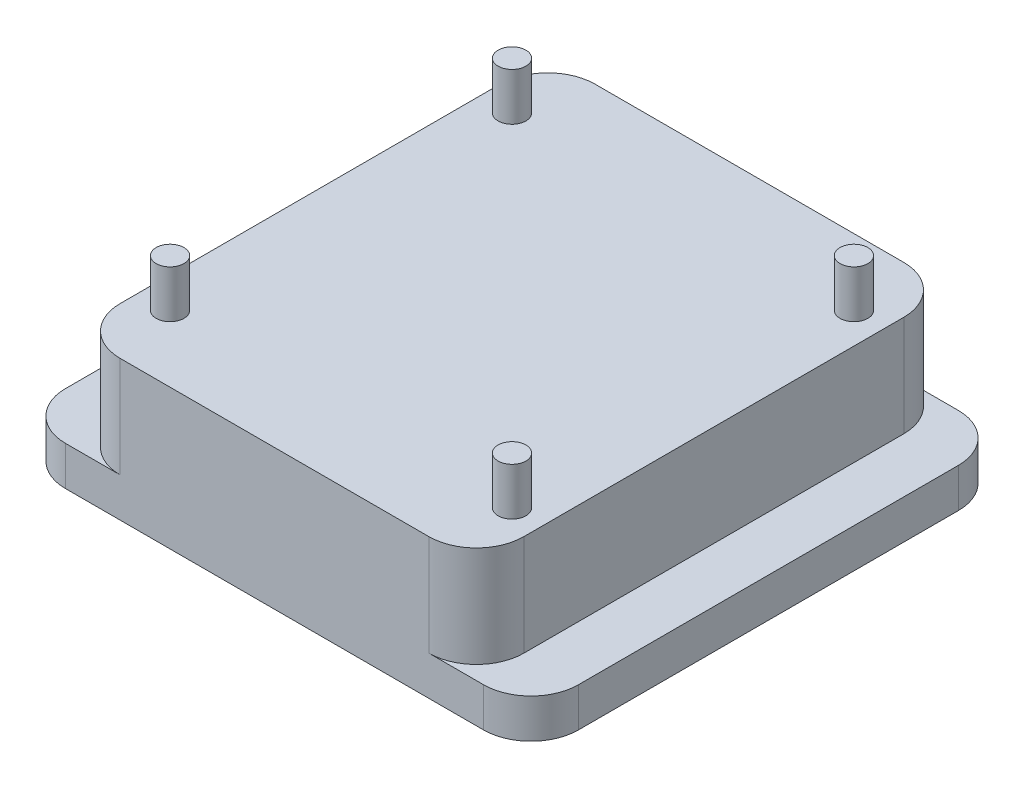
ISO-10303-21;
HEADER;
FILE_DESCRIPTION(('STEP AP214'),'2;1');
FILE_NAME('part.step','',(''),(''),'','','');
FILE_SCHEMA(('AUTOMOTIVE_DESIGN { 1 0 10303 214 1 1 1 1 }'));
ENDSEC;
DATA;
#1=APPLICATION_CONTEXT('core data for automotive mechanical design processes');
#2=APPLICATION_PROTOCOL_DEFINITION('international standard','automotive_design',2000,#1);
#3=PRODUCT_CONTEXT('',#1,'mechanical');
#4=PRODUCT('Part','Part','',(#3));
#5=PRODUCT_RELATED_PRODUCT_CATEGORY('part','',(#4));
#6=PRODUCT_DEFINITION_FORMATION('','',#4);
#7=PRODUCT_DEFINITION_CONTEXT('part definition',#1,'design');
#8=PRODUCT_DEFINITION('design','',#6,#7);
#9=PRODUCT_DEFINITION_SHAPE('','',#8);
#10=(LENGTH_UNIT() NAMED_UNIT(*) SI_UNIT(.MILLI.,.METRE.));
#11=(NAMED_UNIT(*) PLANE_ANGLE_UNIT() SI_UNIT($,.RADIAN.));
#12=(NAMED_UNIT(*) SI_UNIT($,.STERADIAN.) SOLID_ANGLE_UNIT());
#13=UNCERTAINTY_MEASURE_WITH_UNIT(LENGTH_MEASURE(1.E-05),#10,'distance_accuracy_value','');
#14=(GEOMETRIC_REPRESENTATION_CONTEXT(3) GLOBAL_UNCERTAINTY_ASSIGNED_CONTEXT((#13)) GLOBAL_UNIT_ASSIGNED_CONTEXT((#10,
#11,#12)) REPRESENTATION_CONTEXT('',''));
#15=CARTESIAN_POINT('',(0.,0.,0.));
#16=DIRECTION('',(0.,0.,1.));
#17=DIRECTION('',(1.,0.,0.));
#18=AXIS2_PLACEMENT_3D('',#15,#16,#17);
#19=CARTESIAN_POINT('',(-21.59,0.,50.8));
#20=DIRECTION('',(-1.,0.,0.));
#21=DIRECTION('',(0.,0.,1.));
#22=AXIS2_PLACEMENT_3D('',#19,#20,#21);
#23=PLANE('',#22);
#24=DIRECTION('',(0.,0.,-1.));
#25=VECTOR('',#24,1.);
#26=CARTESIAN_POINT('',(-21.59,12.8905,50.8));
#27=LINE('',#26,#25);
#28=CARTESIAN_POINT('',(-21.59,12.8905,45.72));
#29=VERTEX_POINT('',#28);
#30=CARTESIAN_POINT('',(-21.59,12.8905,5.08));
#31=VERTEX_POINT('',#30);
#32=EDGE_CURVE('E193',#29,#31,#27,.T.);
#33=ORIENTED_EDGE('',*,*,#32,.T.);
#34=DIRECTION('',(0.,1.,0.));
#35=VECTOR('',#34,1.);
#36=CARTESIAN_POINT('',(-21.59,2.0955,5.08));
#37=LINE('',#36,#35);
#38=CARTESIAN_POINT('',(-21.59,2.0955,5.08));
#39=VERTEX_POINT('',#38);
#40=EDGE_CURVE('E158',#31,#39,#37,.F.);
#41=ORIENTED_EDGE('',*,*,#40,.T.);
#42=DIRECTION('',(0.,0.,-1.));
#43=VECTOR('',#42,1.);
#44=CARTESIAN_POINT('',(-21.59,2.0955,50.8));
#45=LINE('',#44,#43);
#46=CARTESIAN_POINT('',(-21.59,2.0955,45.72));
#47=VERTEX_POINT('',#46);
#48=EDGE_CURVE('E212',#47,#39,#45,.T.);
#49=ORIENTED_EDGE('',*,*,#48,.F.);
#50=DIRECTION('',(0.,1.,0.));
#51=VECTOR('',#50,1.);
#52=CARTESIAN_POINT('',(-21.59,0.,45.72));
#53=LINE('',#52,#51);
#54=EDGE_CURVE('E163',#47,#29,#53,.T.);
#55=ORIENTED_EDGE('',*,*,#54,.T.);
#56=EDGE_LOOP('',(#33,#41,#49,#55));
#57=FACE_BOUND('',#56,.T.);
#58=ADVANCED_FACE('F39',(#57),#23,.T.);
#59=CARTESIAN_POINT('',(0.,2.0955,50.8));
#60=DIRECTION('',(0.,1.,0.));
#61=DIRECTION('',(0.,0.,1.));
#62=AXIS2_PLACEMENT_3D('',#59,#60,#61);
#63=PLANE('',#62);
#64=DIRECTION('',(0.,0.,-1.));
#65=VECTOR('',#64,1.);
#66=CARTESIAN_POINT('',(-27.432,2.0955,50.8));
#67=LINE('',#66,#65);
#68=CARTESIAN_POINT('',(-27.432,2.0955,45.72));
#69=VERTEX_POINT('',#68);
#70=CARTESIAN_POINT('',(-27.432,2.0955,5.08));
#71=VERTEX_POINT('',#70);
#72=EDGE_CURVE('E209',#69,#71,#67,.T.);
#73=ORIENTED_EDGE('',*,*,#72,.F.);
#74=CARTESIAN_POINT('',(-22.352,2.0955,45.72));
#75=DIRECTION('',(0.,1.,0.));
#76=DIRECTION('',(0.,0.,1.));
#77=AXIS2_PLACEMENT_3D('',#74,#75,#76);
#78=CIRCLE('',#77,5.08);
#79=CARTESIAN_POINT('',(-22.352,2.0955,50.8));
#80=VERTEX_POINT('',#79);
#81=EDGE_CURVE('E250',#69,#80,#78,.T.);
#82=ORIENTED_EDGE('',*,*,#81,.T.);
#83=DIRECTION('',(1.,0.,0.));
#84=VECTOR('',#83,1.);
#85=CARTESIAN_POINT('',(0.,2.0955,50.8));
#86=LINE('',#85,#84);
#87=CARTESIAN_POINT('',(-16.51,2.0955,50.8));
#88=VERTEX_POINT('',#87);
#89=EDGE_CURVE('E182',#80,#88,#86,.T.);
#90=ORIENTED_EDGE('',*,*,#89,.T.);
#91=CARTESIAN_POINT('',(-16.51,2.0955,45.72));
#92=DIRECTION('',(0.,1.,0.));
#93=DIRECTION('',(0.,0.,1.));
#94=AXIS2_PLACEMENT_3D('',#91,#92,#93);
#95=CIRCLE('',#94,5.08);
#96=EDGE_CURVE('E241',#88,#47,#95,.F.);
#97=ORIENTED_EDGE('',*,*,#96,.T.);
#98=ORIENTED_EDGE('',*,*,#48,.T.);
#99=CARTESIAN_POINT('',(-16.51,2.0955,5.08));
#100=DIRECTION('',(0.,1.,0.));
#101=DIRECTION('',(0.,0.,1.));
#102=AXIS2_PLACEMENT_3D('',#99,#100,#101);
#103=CIRCLE('',#102,5.08);
#104=CARTESIAN_POINT('',(-16.51,2.0955,0.));
#105=VERTEX_POINT('',#104);
#106=EDGE_CURVE('E234',#39,#105,#103,.F.);
#107=ORIENTED_EDGE('',*,*,#106,.T.);
#108=DIRECTION('',(1.,0.,0.));
#109=VECTOR('',#108,1.);
#110=CARTESIAN_POINT('',(0.,2.0955,0.));
#111=LINE('',#110,#109);
#112=CARTESIAN_POINT('',(-22.352,2.0955,0.));
#113=VERTEX_POINT('',#112);
#114=EDGE_CURVE('E175',#113,#105,#111,.T.);
#115=ORIENTED_EDGE('',*,*,#114,.F.);
#116=CARTESIAN_POINT('',(-22.352,2.0955,5.08));
#117=DIRECTION('',(0.,1.,0.));
#118=DIRECTION('',(0.,0.,1.));
#119=AXIS2_PLACEMENT_3D('',#116,#117,#118);
#120=CIRCLE('',#119,5.08);
#121=EDGE_CURVE('E248',#113,#71,#120,.T.);
#122=ORIENTED_EDGE('',*,*,#121,.T.);
#123=EDGE_LOOP('',(#73,#82,#90,#97,#98,#107,#115,#122));
#124=FACE_BOUND('',#123,.T.);
#125=ADVANCED_FACE('F343',(#124),#63,.T.);
#126=CARTESIAN_POINT('',(-27.432,0.,50.8));
#127=DIRECTION('',(-1.,0.,0.));
#128=DIRECTION('',(0.,0.,1.));
#129=AXIS2_PLACEMENT_3D('',#126,#127,#128);
#130=PLANE('',#129);
#131=DIRECTION('',(0.,0.,-1.));
#132=VECTOR('',#131,1.);
#133=CARTESIAN_POINT('',(-27.432,-2.0955,50.8));
#134=LINE('',#133,#132);
#135=CARTESIAN_POINT('',(-27.432,-2.0955,45.72));
#136=VERTEX_POINT('',#135);
#137=CARTESIAN_POINT('',(-27.432,-2.0955,5.08));
#138=VERTEX_POINT('',#137);
#139=EDGE_CURVE('E206',#136,#138,#134,.T.);
#140=ORIENTED_EDGE('',*,*,#139,.F.);
#141=DIRECTION('',(0.,1.,0.));
#142=VECTOR('',#141,1.);
#143=CARTESIAN_POINT('',(-27.432,0.,45.72));
#144=LINE('',#143,#142);
#145=EDGE_CURVE('E245',#136,#69,#144,.T.);
#146=ORIENTED_EDGE('',*,*,#145,.T.);
#147=ORIENTED_EDGE('',*,*,#72,.T.);
#148=DIRECTION('',(0.,1.,0.));
#149=VECTOR('',#148,1.);
#150=CARTESIAN_POINT('',(-27.432,-2.0955,5.08));
#151=LINE('',#150,#149);
#152=EDGE_CURVE('E243',#71,#138,#151,.F.);
#153=ORIENTED_EDGE('',*,*,#152,.T.);
#154=EDGE_LOOP('',(#140,#146,#147,#153));
#155=FACE_BOUND('',#154,.T.);
#156=ADVANCED_FACE('F349',(#155),#130,.T.);
#157=CARTESIAN_POINT('',(0.,-2.0955,50.8));
#158=DIRECTION('',(0.,1.,0.));
#159=DIRECTION('',(0.,0.,1.));
#160=AXIS2_PLACEMENT_3D('',#157,#158,#159);
#161=PLANE('',#160);
#162=DIRECTION('',(1.,0.,0.));
#163=VECTOR('',#162,1.);
#164=CARTESIAN_POINT('',(0.,-2.0955,50.8));
#165=LINE('',#164,#163);
#166=CARTESIAN_POINT('',(-22.352,-2.0955,50.8));
#167=VERTEX_POINT('',#166);
#168=CARTESIAN_POINT('',(22.352,-2.0955,50.8));
#169=VERTEX_POINT('',#168);
#170=EDGE_CURVE('E185',#167,#169,#165,.T.);
#171=ORIENTED_EDGE('',*,*,#170,.F.);
#172=CARTESIAN_POINT('',(-22.352,-2.0955,45.72));
#173=DIRECTION('',(0.,1.,0.));
#174=DIRECTION('',(0.,0.,1.));
#175=AXIS2_PLACEMENT_3D('',#172,#173,#174);
#176=CIRCLE('',#175,5.08);
#177=EDGE_CURVE('E263',#167,#136,#176,.F.);
#178=ORIENTED_EDGE('',*,*,#177,.T.);
#179=ORIENTED_EDGE('',*,*,#139,.T.);
#180=CARTESIAN_POINT('',(-22.352,-2.0955,5.08));
#181=DIRECTION('',(0.,1.,0.));
#182=DIRECTION('',(0.,0.,1.));
#183=AXIS2_PLACEMENT_3D('',#180,#181,#182);
#184=CIRCLE('',#183,5.08);
#185=CARTESIAN_POINT('',(-22.352,-2.0955,0.));
#186=VERTEX_POINT('',#185);
#187=EDGE_CURVE('E261',#138,#186,#184,.F.);
#188=ORIENTED_EDGE('',*,*,#187,.T.);
#189=DIRECTION('',(1.,0.,0.));
#190=VECTOR('',#189,1.);
#191=CARTESIAN_POINT('',(0.,-2.0955,0.));
#192=LINE('',#191,#190);
#193=CARTESIAN_POINT('',(22.352,-2.0955,0.));
#194=VERTEX_POINT('',#193);
#195=EDGE_CURVE('E189',#186,#194,#192,.T.);
#196=ORIENTED_EDGE('',*,*,#195,.T.);
#197=CARTESIAN_POINT('',(22.352,-2.0955,5.08));
#198=DIRECTION('',(0.,1.,0.));
#199=DIRECTION('',(0.,0.,1.));
#200=AXIS2_PLACEMENT_3D('',#197,#198,#199);
#201=CIRCLE('',#200,5.08);
#202=CARTESIAN_POINT('',(27.432,-2.0955,5.08));
#203=VERTEX_POINT('',#202);
#204=EDGE_CURVE('E257',#194,#203,#201,.F.);
#205=ORIENTED_EDGE('',*,*,#204,.T.);
#206=DIRECTION('',(0.,0.,-1.));
#207=VECTOR('',#206,1.);
#208=CARTESIAN_POINT('',(27.432,-2.0955,50.8));
#209=LINE('',#208,#207);
#210=CARTESIAN_POINT('',(27.432,-2.0955,45.72));
#211=VERTEX_POINT('',#210);
#212=EDGE_CURVE('E203',#211,#203,#209,.T.);
#213=ORIENTED_EDGE('',*,*,#212,.F.);
#214=CARTESIAN_POINT('',(22.352,-2.0955,45.72));
#215=DIRECTION('',(0.,1.,0.));
#216=DIRECTION('',(0.,0.,1.));
#217=AXIS2_PLACEMENT_3D('',#214,#215,#216);
#218=CIRCLE('',#217,5.08);
#219=EDGE_CURVE('E259',#211,#169,#218,.F.);
#220=ORIENTED_EDGE('',*,*,#219,.T.);
#221=EDGE_LOOP('',(#171,#178,#179,#188,#196,#205,#213,#220));
#222=FACE_BOUND('',#221,.T.);
#223=ADVANCED_FACE('F280',(#222),#161,.F.);
#224=CARTESIAN_POINT('',(27.432,0.,50.8));
#225=DIRECTION('',(-1.,0.,0.));
#226=DIRECTION('',(0.,0.,1.));
#227=AXIS2_PLACEMENT_3D('',#224,#225,#226);
#228=PLANE('',#227);
#229=DIRECTION('',(0.,0.,-1.));
#230=VECTOR('',#229,1.);
#231=CARTESIAN_POINT('',(27.432,2.0955,50.8));
#232=LINE('',#231,#230);
#233=CARTESIAN_POINT('',(27.432,2.0955,45.72));
#234=VERTEX_POINT('',#233);
#235=CARTESIAN_POINT('',(27.432,2.0955,5.08));
#236=VERTEX_POINT('',#235);
#237=EDGE_CURVE('E201',#234,#236,#232,.T.);
#238=ORIENTED_EDGE('',*,*,#237,.F.);
#239=DIRECTION('',(0.,1.,0.));
#240=VECTOR('',#239,1.);
#241=CARTESIAN_POINT('',(27.432,-2.0955,45.72));
#242=LINE('',#241,#240);
#243=EDGE_CURVE('E11',#234,#211,#242,.F.);
#244=ORIENTED_EDGE('',*,*,#243,.T.);
#245=ORIENTED_EDGE('',*,*,#212,.T.);
#246=DIRECTION('',(0.,1.,0.));
#247=VECTOR('',#246,1.);
#248=CARTESIAN_POINT('',(27.432,0.,5.08));
#249=LINE('',#248,#247);
#250=EDGE_CURVE('E47',#203,#236,#249,.T.);
#251=ORIENTED_EDGE('',*,*,#250,.T.);
#252=EDGE_LOOP('',(#238,#244,#245,#251));
#253=FACE_BOUND('',#252,.T.);
#254=ADVANCED_FACE('F271',(#253),#228,.F.);
#255=CARTESIAN_POINT('',(16.51,2.0955,50.8));
#256=VERTEX_POINT('',#255);
#257=CARTESIAN_POINT('',(22.352,2.0955,50.8));
#258=VERTEX_POINT('',#257);
#259=EDGE_CURVE('E187',#256,#258,#86,.T.);
#260=ORIENTED_EDGE('',*,*,#259,.T.);
#261=CARTESIAN_POINT('',(22.352,2.0955,45.72));
#262=DIRECTION('',(0.,1.,0.));
#263=DIRECTION('',(0.,0.,1.));
#264=AXIS2_PLACEMENT_3D('',#261,#262,#263);
#265=CIRCLE('',#264,5.08);
#266=EDGE_CURVE('E62',#258,#234,#265,.T.);
#267=ORIENTED_EDGE('',*,*,#266,.T.);
#268=ORIENTED_EDGE('',*,*,#237,.T.);
#269=CARTESIAN_POINT('',(22.352,2.0955,5.08));
#270=DIRECTION('',(0.,1.,0.));
#271=DIRECTION('',(0.,0.,1.));
#272=AXIS2_PLACEMENT_3D('',#269,#270,#271);
#273=CIRCLE('',#272,5.08);
#274=CARTESIAN_POINT('',(22.352,2.0955,0.));
#275=VERTEX_POINT('',#274);
#276=EDGE_CURVE('E54',#236,#275,#273,.T.);
#277=ORIENTED_EDGE('',*,*,#276,.T.);
#278=CARTESIAN_POINT('',(16.51,2.0955,0.));
#279=VERTEX_POINT('',#278);
#280=EDGE_CURVE('E183',#279,#275,#111,.T.);
#281=ORIENTED_EDGE('',*,*,#280,.F.);
#282=CARTESIAN_POINT('',(16.51,2.0955,5.08));
#283=DIRECTION('',(0.,1.,0.));
#284=DIRECTION('',(0.,0.,1.));
#285=AXIS2_PLACEMENT_3D('',#282,#283,#284);
#286=CIRCLE('',#285,5.08);
#287=CARTESIAN_POINT('',(21.59,2.0955,5.08));
#288=VERTEX_POINT('',#287);
#289=EDGE_CURVE('E236',#279,#288,#286,.F.);
#290=ORIENTED_EDGE('',*,*,#289,.T.);
#291=DIRECTION('',(0.,0.,-1.));
#292=VECTOR('',#291,1.);
#293=CARTESIAN_POINT('',(21.59,2.0955,50.8));
#294=LINE('',#293,#292);
#295=CARTESIAN_POINT('',(21.59,2.0955,45.72));
#296=VERTEX_POINT('',#295);
#297=EDGE_CURVE('E198',#296,#288,#294,.T.);
#298=ORIENTED_EDGE('',*,*,#297,.F.);
#299=CARTESIAN_POINT('',(16.51,2.0955,45.72));
#300=DIRECTION('',(0.,1.,0.));
#301=DIRECTION('',(0.,0.,1.));
#302=AXIS2_PLACEMENT_3D('',#299,#300,#301);
#303=CIRCLE('',#302,5.08);
#304=EDGE_CURVE('E238',#296,#256,#303,.F.);
#305=ORIENTED_EDGE('',*,*,#304,.T.);
#306=EDGE_LOOP('',(#260,#267,#268,#277,#281,#290,#298,#305));
#307=FACE_BOUND('',#306,.T.);
#308=ADVANCED_FACE('F275',(#307),#63,.T.);
#309=CARTESIAN_POINT('',(21.59,0.,50.8));
#310=DIRECTION('',(-1.,0.,0.));
#311=DIRECTION('',(0.,0.,1.));
#312=AXIS2_PLACEMENT_3D('',#309,#310,#311);
#313=PLANE('',#312);
#314=ORIENTED_EDGE('',*,*,#297,.T.);
#315=DIRECTION('',(0.,1.,0.));
#316=VECTOR('',#315,1.);
#317=CARTESIAN_POINT('',(21.59,0.,5.08));
#318=LINE('',#317,#316);
#319=CARTESIAN_POINT('',(21.59,12.8905,5.08));
#320=VERTEX_POINT('',#319);
#321=EDGE_CURVE('E225',#288,#320,#318,.T.);
#322=ORIENTED_EDGE('',*,*,#321,.T.);
#323=DIRECTION('',(0.,0.,-1.));
#324=VECTOR('',#323,1.);
#325=CARTESIAN_POINT('',(21.59,12.8905,50.8));
#326=LINE('',#325,#324);
#327=CARTESIAN_POINT('',(21.59,12.8905,45.72));
#328=VERTEX_POINT('',#327);
#329=EDGE_CURVE('E195',#328,#320,#326,.T.);
#330=ORIENTED_EDGE('',*,*,#329,.F.);
#331=DIRECTION('',(0.,1.,0.));
#332=VECTOR('',#331,1.);
#333=CARTESIAN_POINT('',(21.59,2.0955,45.72));
#334=LINE('',#333,#332);
#335=EDGE_CURVE('E223',#328,#296,#334,.F.);
#336=ORIENTED_EDGE('',*,*,#335,.T.);
#337=EDGE_LOOP('',(#314,#322,#330,#336));
#338=FACE_BOUND('',#337,.T.);
#339=ADVANCED_FACE('F319',(#338),#313,.F.);
#340=CARTESIAN_POINT('',(0.,12.8905,50.8));
#341=DIRECTION('',(0.,1.,0.));
#342=DIRECTION('',(0.,0.,1.));
#343=AXIS2_PLACEMENT_3D('',#340,#341,#342);
#344=PLANE('',#343);
#345=CARTESIAN_POINT('',(-18.288,12.8905,7.112));
#346=DIRECTION('',(0.,1.,0.));
#347=DIRECTION('',(0.,0.,1.));
#348=AXIS2_PLACEMENT_3D('',#345,#346,#347);
#349=CIRCLE('',#348,1.4859);
#350=CARTESIAN_POINT('',(-18.288,12.8905,8.5979));
#351=VERTEX_POINT('',#350);
#352=EDGE_CURVE('E305',#351,#351,#349,.T.);
#353=ORIENTED_EDGE('',*,*,#352,.F.);
#354=EDGE_LOOP('',(#353));
#355=FACE_BOUND('',#354,.T.);
#356=CARTESIAN_POINT('',(-18.288,12.8905,43.688));
#357=DIRECTION('',(0.,1.,0.));
#358=DIRECTION('',(0.,0.,1.));
#359=AXIS2_PLACEMENT_3D('',#356,#357,#358);
#360=CIRCLE('',#359,1.4859);
#361=CARTESIAN_POINT('',(-18.288,12.8905,45.1739));
#362=VERTEX_POINT('',#361);
#363=EDGE_CURVE('E299',#362,#362,#360,.T.);
#364=ORIENTED_EDGE('',*,*,#363,.F.);
#365=EDGE_LOOP('',(#364));
#366=FACE_BOUND('',#365,.T.);
#367=CARTESIAN_POINT('',(18.288,12.8905,43.688));
#368=DIRECTION('',(0.,1.,0.));
#369=DIRECTION('',(0.,0.,1.));
#370=AXIS2_PLACEMENT_3D('',#367,#368,#369);
#371=CIRCLE('',#370,1.4859);
#372=CARTESIAN_POINT('',(18.288,12.8905,45.1739));
#373=VERTEX_POINT('',#372);
#374=EDGE_CURVE('E294',#373,#373,#371,.T.);
#375=ORIENTED_EDGE('',*,*,#374,.F.);
#376=EDGE_LOOP('',(#375));
#377=FACE_BOUND('',#376,.T.);
#378=CARTESIAN_POINT('',(18.288,12.8905,7.112));
#379=DIRECTION('',(0.,1.,0.));
#380=DIRECTION('',(0.,0.,1.));
#381=AXIS2_PLACEMENT_3D('',#378,#379,#380);
#382=CIRCLE('',#381,1.4859);
#383=CARTESIAN_POINT('',(18.288,12.8905,8.5979));
#384=VERTEX_POINT('',#383);
#385=EDGE_CURVE('E286',#384,#384,#382,.T.);
#386=ORIENTED_EDGE('',*,*,#385,.F.);
#387=EDGE_LOOP('',(#386));
#388=FACE_BOUND('',#387,.T.);
#389=DIRECTION('',(1.,0.,0.));
#390=VECTOR('',#389,1.);
#391=CARTESIAN_POINT('',(0.,12.8905,0.));
#392=LINE('',#391,#390);
#393=CARTESIAN_POINT('',(-16.51,12.8905,0.));
#394=VERTEX_POINT('',#393);
#395=CARTESIAN_POINT('',(16.51,12.8905,0.));
#396=VERTEX_POINT('',#395);
#397=EDGE_CURVE('E171',#394,#396,#392,.T.);
#398=ORIENTED_EDGE('',*,*,#397,.F.);
#399=CARTESIAN_POINT('',(-16.51,12.8905,5.08));
#400=DIRECTION('',(0.,1.,0.));
#401=DIRECTION('',(0.,0.,1.));
#402=AXIS2_PLACEMENT_3D('',#399,#400,#401);
#403=CIRCLE('',#402,5.08);
#404=EDGE_CURVE('E153',#394,#31,#403,.T.);
#405=ORIENTED_EDGE('',*,*,#404,.T.);
#406=ORIENTED_EDGE('',*,*,#32,.F.);
#407=CARTESIAN_POINT('',(-16.51,12.8905,45.72));
#408=DIRECTION('',(0.,1.,0.));
#409=DIRECTION('',(0.,0.,1.));
#410=AXIS2_PLACEMENT_3D('',#407,#408,#409);
#411=CIRCLE('',#410,5.08);
#412=CARTESIAN_POINT('',(-16.51,12.8905,50.8));
#413=VERTEX_POINT('',#412);
#414=EDGE_CURVE('E177',#29,#413,#411,.T.);
#415=ORIENTED_EDGE('',*,*,#414,.T.);
#416=DIRECTION('',(1.,0.,0.));
#417=VECTOR('',#416,1.);
#418=CARTESIAN_POINT('',(0.,12.8905,50.8));
#419=LINE('',#418,#417);
#420=CARTESIAN_POINT('',(16.51,12.8905,50.8));
#421=VERTEX_POINT('',#420);
#422=EDGE_CURVE('E196',#413,#421,#419,.T.);
#423=ORIENTED_EDGE('',*,*,#422,.T.);
#424=CARTESIAN_POINT('',(16.51,12.8905,45.72));
#425=DIRECTION('',(0.,1.,0.));
#426=DIRECTION('',(0.,0.,1.));
#427=AXIS2_PLACEMENT_3D('',#424,#425,#426);
#428=CIRCLE('',#427,5.08);
#429=EDGE_CURVE('E217',#421,#328,#428,.T.);
#430=ORIENTED_EDGE('',*,*,#429,.T.);
#431=ORIENTED_EDGE('',*,*,#329,.T.);
#432=CARTESIAN_POINT('',(16.51,12.8905,5.08));
#433=DIRECTION('',(0.,1.,0.));
#434=DIRECTION('',(0.,0.,1.));
#435=AXIS2_PLACEMENT_3D('',#432,#433,#434);
#436=CIRCLE('',#435,5.08);
#437=EDGE_CURVE('E164',#320,#396,#436,.T.);
#438=ORIENTED_EDGE('',*,*,#437,.T.);
#439=EDGE_LOOP('',(#398,#405,#406,#415,#423,#430,#431,#438));
#440=FACE_BOUND('',#439,.T.);
#441=ADVANCED_FACE('F180',(#355,#366,#377,#388,#440),#344,.T.);
#442=CARTESIAN_POINT('',(0.,0.,50.8));
#443=DIRECTION('',(0.,0.,1.));
#444=DIRECTION('',(1.,0.,0.));
#445=AXIS2_PLACEMENT_3D('',#442,#443,#444);
#446=PLANE('',#445);
#447=ORIENTED_EDGE('',*,*,#89,.F.);
#448=DIRECTION('',(0.,1.,0.));
#449=VECTOR('',#448,1.);
#450=CARTESIAN_POINT('',(-22.352,0.,50.8));
#451=LINE('',#450,#449);
#452=EDGE_CURVE('E255',#80,#167,#451,.F.);
#453=ORIENTED_EDGE('',*,*,#452,.T.);
#454=ORIENTED_EDGE('',*,*,#170,.T.);
#455=DIRECTION('',(0.,1.,0.));
#456=VECTOR('',#455,1.);
#457=CARTESIAN_POINT('',(22.352,2.0955,50.8));
#458=LINE('',#457,#456);
#459=EDGE_CURVE('E252',#169,#258,#458,.T.);
#460=ORIENTED_EDGE('',*,*,#459,.T.);
#461=ORIENTED_EDGE('',*,*,#259,.F.);
#462=DIRECTION('',(0.,1.,0.));
#463=VECTOR('',#462,1.);
#464=CARTESIAN_POINT('',(16.51,12.8905,50.8));
#465=LINE('',#464,#463);
#466=EDGE_CURVE('E231',#256,#421,#465,.T.);
#467=ORIENTED_EDGE('',*,*,#466,.T.);
#468=ORIENTED_EDGE('',*,*,#422,.F.);
#469=DIRECTION('',(0.,1.,0.));
#470=VECTOR('',#469,1.);
#471=CARTESIAN_POINT('',(-16.51,0.,50.8));
#472=LINE('',#471,#470);
#473=EDGE_CURVE('E228',#413,#88,#472,.F.);
#474=ORIENTED_EDGE('',*,*,#473,.T.);
#475=EDGE_LOOP('',(#447,#453,#454,#460,#461,#467,#468,#474));
#476=FACE_BOUND('',#475,.T.);
#477=ADVANCED_FACE('F318',(#476),#446,.T.);
#478=CARTESIAN_POINT('',(0.,0.,0.));
#479=DIRECTION('',(0.,0.,1.));
#480=DIRECTION('',(1.,0.,0.));
#481=AXIS2_PLACEMENT_3D('',#478,#479,#480);
#482=PLANE('',#481);
#483=ORIENTED_EDGE('',*,*,#195,.F.);
#484=DIRECTION('',(0.,1.,0.));
#485=VECTOR('',#484,1.);
#486=CARTESIAN_POINT('',(-22.352,2.0955,0.));
#487=LINE('',#486,#485);
#488=EDGE_CURVE('E267',#186,#113,#487,.T.);
#489=ORIENTED_EDGE('',*,*,#488,.T.);
#490=ORIENTED_EDGE('',*,*,#114,.T.);
#491=DIRECTION('',(0.,1.,0.));
#492=VECTOR('',#491,1.);
#493=CARTESIAN_POINT('',(-16.51,12.8905,0.));
#494=LINE('',#493,#492);
#495=EDGE_CURVE('E157',#105,#394,#494,.T.);
#496=ORIENTED_EDGE('',*,*,#495,.T.);
#497=ORIENTED_EDGE('',*,*,#397,.T.);
#498=DIRECTION('',(0.,1.,0.));
#499=VECTOR('',#498,1.);
#500=CARTESIAN_POINT('',(16.51,0.,0.));
#501=LINE('',#500,#499);
#502=EDGE_CURVE('E178',#396,#279,#501,.F.);
#503=ORIENTED_EDGE('',*,*,#502,.T.);
#504=ORIENTED_EDGE('',*,*,#280,.T.);
#505=DIRECTION('',(0.,1.,0.));
#506=VECTOR('',#505,1.);
#507=CARTESIAN_POINT('',(22.352,0.,0.));
#508=LINE('',#507,#506);
#509=EDGE_CURVE('E265',#275,#194,#508,.F.);
#510=ORIENTED_EDGE('',*,*,#509,.T.);
#511=EDGE_LOOP('',(#483,#489,#490,#496,#497,#503,#504,#510));
#512=FACE_BOUND('',#511,.T.);
#513=ADVANCED_FACE('F169',(#512),#482,.F.);
#514=CARTESIAN_POINT('',(18.288,17.9705,7.112));
#515=DIRECTION('',(0.,-1.,0.));
#516=DIRECTION('',(0.,0.,-1.));
#517=AXIS2_PLACEMENT_3D('',#514,#515,#516);
#518=CYLINDRICAL_SURFACE('',#517,1.4859);
#519=CARTESIAN_POINT('',(18.288,17.9705,7.112));
#520=DIRECTION('',(0.,1.,0.));
#521=DIRECTION('',(0.,0.,1.));
#522=AXIS2_PLACEMENT_3D('',#519,#520,#521);
#523=CIRCLE('',#522,1.4859);
#524=CARTESIAN_POINT('',(18.288,17.9705,8.5979));
#525=VERTEX_POINT('',#524);
#526=EDGE_CURVE('E284',#525,#525,#523,.T.);
#527=ORIENTED_EDGE('',*,*,#526,.F.);
#528=EDGE_LOOP('',(#527));
#529=FACE_BOUND('',#528,.T.);
#530=ORIENTED_EDGE('',*,*,#385,.T.);
#531=EDGE_LOOP('',(#530));
#532=FACE_BOUND('',#531,.T.);
#533=ADVANCED_FACE('F327',(#529,#532),#518,.T.);
#534=CARTESIAN_POINT('',(18.288,17.9705,7.112));
#535=DIRECTION('',(0.,1.,0.));
#536=DIRECTION('',(0.,0.,1.));
#537=AXIS2_PLACEMENT_3D('',#534,#535,#536);
#538=PLANE('',#537);
#539=ORIENTED_EDGE('',*,*,#526,.T.);
#540=EDGE_LOOP('',(#539));
#541=FACE_BOUND('',#540,.T.);
#542=ADVANCED_FACE('F329',(#541),#538,.T.);
#543=CARTESIAN_POINT('',(18.288,17.9705,43.688));
#544=DIRECTION('',(0.,-1.,0.));
#545=DIRECTION('',(0.,0.,-1.));
#546=AXIS2_PLACEMENT_3D('',#543,#544,#545);
#547=CYLINDRICAL_SURFACE('',#546,1.4859);
#548=CARTESIAN_POINT('',(18.288,17.9705,43.688));
#549=DIRECTION('',(0.,1.,0.));
#550=DIRECTION('',(0.,0.,1.));
#551=AXIS2_PLACEMENT_3D('',#548,#549,#550);
#552=CIRCLE('',#551,1.4859);
#553=CARTESIAN_POINT('',(18.288,17.9705,45.1739));
#554=VERTEX_POINT('',#553);
#555=EDGE_CURVE('E296',#554,#554,#552,.T.);
#556=ORIENTED_EDGE('',*,*,#555,.F.);
#557=EDGE_LOOP('',(#556));
#558=FACE_BOUND('',#557,.T.);
#559=ORIENTED_EDGE('',*,*,#374,.T.);
#560=EDGE_LOOP('',(#559));
#561=FACE_BOUND('',#560,.T.);
#562=ADVANCED_FACE('F336',(#558,#561),#547,.T.);
#563=CARTESIAN_POINT('',(18.288,17.9705,43.688));
#564=DIRECTION('',(0.,1.,0.));
#565=DIRECTION('',(0.,0.,1.));
#566=AXIS2_PLACEMENT_3D('',#563,#564,#565);
#567=PLANE('',#566);
#568=ORIENTED_EDGE('',*,*,#555,.T.);
#569=EDGE_LOOP('',(#568));
#570=FACE_BOUND('',#569,.T.);
#571=ADVANCED_FACE('F512',(#570),#567,.T.);
#572=CARTESIAN_POINT('',(-18.288,17.9705,43.688));
#573=DIRECTION('',(0.,-1.,0.));
#574=DIRECTION('',(0.,0.,-1.));
#575=AXIS2_PLACEMENT_3D('',#572,#573,#574);
#576=CYLINDRICAL_SURFACE('',#575,1.4859);
#577=CARTESIAN_POINT('',(-18.288,17.9705,43.688));
#578=DIRECTION('',(0.,1.,0.));
#579=DIRECTION('',(0.,0.,1.));
#580=AXIS2_PLACEMENT_3D('',#577,#578,#579);
#581=CIRCLE('',#580,1.4859);
#582=CARTESIAN_POINT('',(-18.288,17.9705,45.1739));
#583=VERTEX_POINT('',#582);
#584=EDGE_CURVE('E302',#583,#583,#581,.T.);
#585=ORIENTED_EDGE('',*,*,#584,.F.);
#586=EDGE_LOOP('',(#585));
#587=FACE_BOUND('',#586,.T.);
#588=ORIENTED_EDGE('',*,*,#363,.T.);
#589=EDGE_LOOP('',(#588));
#590=FACE_BOUND('',#589,.T.);
#591=ADVANCED_FACE('F501',(#587,#590),#576,.T.);
#592=CARTESIAN_POINT('',(-18.288,17.9705,43.688));
#593=DIRECTION('',(0.,1.,0.));
#594=DIRECTION('',(0.,0.,1.));
#595=AXIS2_PLACEMENT_3D('',#592,#593,#594);
#596=PLANE('',#595);
#597=ORIENTED_EDGE('',*,*,#584,.T.);
#598=EDGE_LOOP('',(#597));
#599=FACE_BOUND('',#598,.T.);
#600=ADVANCED_FACE('F490',(#599),#596,.T.);
#601=CARTESIAN_POINT('',(-18.288,17.9705,7.112));
#602=DIRECTION('',(0.,-1.,0.));
#603=DIRECTION('',(0.,0.,-1.));
#604=AXIS2_PLACEMENT_3D('',#601,#602,#603);
#605=CYLINDRICAL_SURFACE('',#604,1.4859);
#606=CARTESIAN_POINT('',(-18.288,17.9705,7.112));
#607=DIRECTION('',(0.,1.,0.));
#608=DIRECTION('',(0.,0.,1.));
#609=AXIS2_PLACEMENT_3D('',#606,#607,#608);
#610=CIRCLE('',#609,1.4859);
#611=CARTESIAN_POINT('',(-18.288,17.9705,8.5979));
#612=VERTEX_POINT('',#611);
#613=EDGE_CURVE('E308',#612,#612,#610,.T.);
#614=ORIENTED_EDGE('',*,*,#613,.F.);
#615=EDGE_LOOP('',(#614));
#616=FACE_BOUND('',#615,.T.);
#617=ORIENTED_EDGE('',*,*,#352,.T.);
#618=EDGE_LOOP('',(#617));
#619=FACE_BOUND('',#618,.T.);
#620=ADVANCED_FACE('F314',(#616,#619),#605,.T.);
#621=CARTESIAN_POINT('',(-18.288,17.9705,7.112));
#622=DIRECTION('',(0.,1.,0.));
#623=DIRECTION('',(0.,0.,1.));
#624=AXIS2_PLACEMENT_3D('',#621,#622,#623);
#625=PLANE('',#624);
#626=ORIENTED_EDGE('',*,*,#613,.T.);
#627=EDGE_LOOP('',(#626));
#628=FACE_BOUND('',#627,.T.);
#629=ADVANCED_FACE('F358',(#628),#625,.T.);
#630=CARTESIAN_POINT('',(-16.51,0.,5.08));
#631=DIRECTION('',(0.,-1.,0.));
#632=DIRECTION('',(0.,0.,-1.));
#633=AXIS2_PLACEMENT_3D('',#630,#631,#632);
#634=CYLINDRICAL_SURFACE('',#633,5.08);
#635=ORIENTED_EDGE('',*,*,#106,.F.);
#636=ORIENTED_EDGE('',*,*,#40,.F.);
#637=ORIENTED_EDGE('',*,*,#404,.F.);
#638=ORIENTED_EDGE('',*,*,#495,.F.);
#639=EDGE_LOOP('',(#635,#636,#637,#638));
#640=FACE_BOUND('',#639,.T.);
#641=ADVANCED_FACE('F156',(#640),#634,.T.);
#642=CARTESIAN_POINT('',(16.51,0.,5.08));
#643=DIRECTION('',(0.,1.,0.));
#644=DIRECTION('',(0.,0.,1.));
#645=AXIS2_PLACEMENT_3D('',#642,#643,#644);
#646=CYLINDRICAL_SURFACE('',#645,5.08);
#647=ORIENTED_EDGE('',*,*,#289,.F.);
#648=ORIENTED_EDGE('',*,*,#502,.F.);
#649=ORIENTED_EDGE('',*,*,#437,.F.);
#650=ORIENTED_EDGE('',*,*,#321,.F.);
#651=EDGE_LOOP('',(#647,#648,#649,#650));
#652=FACE_BOUND('',#651,.T.);
#653=ADVANCED_FACE('F357',(#652),#646,.T.);
#654=CARTESIAN_POINT('',(16.51,0.,45.72));
#655=DIRECTION('',(0.,-1.,0.));
#656=DIRECTION('',(0.,0.,-1.));
#657=AXIS2_PLACEMENT_3D('',#654,#655,#656);
#658=CYLINDRICAL_SURFACE('',#657,5.08);
#659=ORIENTED_EDGE('',*,*,#304,.F.);
#660=ORIENTED_EDGE('',*,*,#335,.F.);
#661=ORIENTED_EDGE('',*,*,#429,.F.);
#662=ORIENTED_EDGE('',*,*,#466,.F.);
#663=EDGE_LOOP('',(#659,#660,#661,#662));
#664=FACE_BOUND('',#663,.T.);
#665=ADVANCED_FACE('F361',(#664),#658,.T.);
#666=CARTESIAN_POINT('',(-16.51,0.,45.72));
#667=DIRECTION('',(0.,1.,0.));
#668=DIRECTION('',(0.,0.,1.));
#669=AXIS2_PLACEMENT_3D('',#666,#667,#668);
#670=CYLINDRICAL_SURFACE('',#669,5.08);
#671=ORIENTED_EDGE('',*,*,#96,.F.);
#672=ORIENTED_EDGE('',*,*,#473,.F.);
#673=ORIENTED_EDGE('',*,*,#414,.F.);
#674=ORIENTED_EDGE('',*,*,#54,.F.);
#675=EDGE_LOOP('',(#671,#672,#673,#674));
#676=FACE_BOUND('',#675,.T.);
#677=ADVANCED_FACE('F365',(#676),#670,.T.);
#678=CARTESIAN_POINT('',(-22.352,0.,45.72));
#679=DIRECTION('',(0.,1.,0.));
#680=DIRECTION('',(0.,0.,1.));
#681=AXIS2_PLACEMENT_3D('',#678,#679,#680);
#682=CYLINDRICAL_SURFACE('',#681,5.08);
#683=ORIENTED_EDGE('',*,*,#177,.F.);
#684=ORIENTED_EDGE('',*,*,#452,.F.);
#685=ORIENTED_EDGE('',*,*,#81,.F.);
#686=ORIENTED_EDGE('',*,*,#145,.F.);
#687=EDGE_LOOP('',(#683,#684,#685,#686));
#688=FACE_BOUND('',#687,.T.);
#689=ADVANCED_FACE('F369',(#688),#682,.T.);
#690=CARTESIAN_POINT('',(-22.352,0.,5.08));
#691=DIRECTION('',(0.,-1.,0.));
#692=DIRECTION('',(0.,0.,-1.));
#693=AXIS2_PLACEMENT_3D('',#690,#691,#692);
#694=CYLINDRICAL_SURFACE('',#693,5.08);
#695=ORIENTED_EDGE('',*,*,#187,.F.);
#696=ORIENTED_EDGE('',*,*,#152,.F.);
#697=ORIENTED_EDGE('',*,*,#121,.F.);
#698=ORIENTED_EDGE('',*,*,#488,.F.);
#699=EDGE_LOOP('',(#695,#696,#697,#698));
#700=FACE_BOUND('',#699,.T.);
#701=ADVANCED_FACE('F373',(#700),#694,.T.);
#702=CARTESIAN_POINT('',(22.352,0.,45.72));
#703=DIRECTION('',(0.,-1.,0.));
#704=DIRECTION('',(0.,0.,-1.));
#705=AXIS2_PLACEMENT_3D('',#702,#703,#704);
#706=CYLINDRICAL_SURFACE('',#705,5.08);
#707=ORIENTED_EDGE('',*,*,#219,.F.);
#708=ORIENTED_EDGE('',*,*,#243,.F.);
#709=ORIENTED_EDGE('',*,*,#266,.F.);
#710=ORIENTED_EDGE('',*,*,#459,.F.);
#711=EDGE_LOOP('',(#707,#708,#709,#710));
#712=FACE_BOUND('',#711,.T.);
#713=ADVANCED_FACE('F376',(#712),#706,.T.);
#714=CARTESIAN_POINT('',(22.352,0.,5.08));
#715=DIRECTION('',(0.,1.,0.));
#716=DIRECTION('',(0.,0.,1.));
#717=AXIS2_PLACEMENT_3D('',#714,#715,#716);
#718=CYLINDRICAL_SURFACE('',#717,5.08);
#719=ORIENTED_EDGE('',*,*,#204,.F.);
#720=ORIENTED_EDGE('',*,*,#509,.F.);
#721=ORIENTED_EDGE('',*,*,#276,.F.);
#722=ORIENTED_EDGE('',*,*,#250,.F.);
#723=EDGE_LOOP('',(#719,#720,#721,#722));
#724=FACE_BOUND('',#723,.T.);
#725=ADVANCED_FACE('F41',(#724),#718,.T.);
#726=CLOSED_SHELL('',(#58,#125,#156,#223,#254,#308,#339,#441,#477,#513,#533,#542,#562,#571,#591,
#600,#620,#629,#641,#653,#665,#677,#689,#701,#713,#725));
#727=MANIFOLD_SOLID_BREP('B2',#726);
#728=ADVANCED_BREP_SHAPE_REPRESENTATION('',(#18,#727),#14);
#729=SHAPE_DEFINITION_REPRESENTATION(#9,#728);
ENDSEC;
END-ISO-10303-21;
